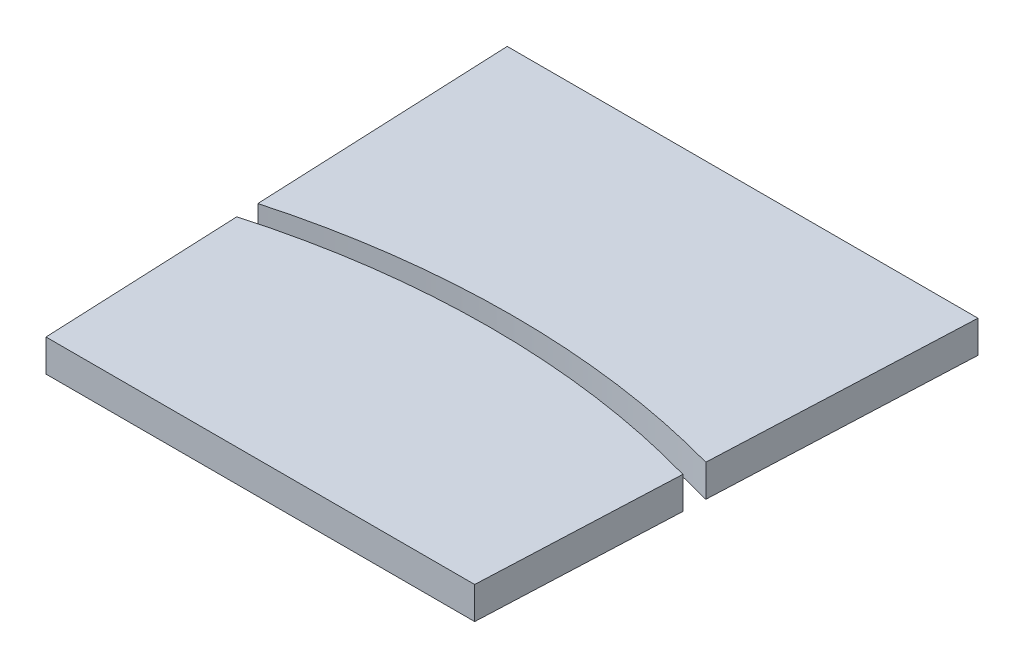
ISO-10303-21;
HEADER;
FILE_DESCRIPTION(('STEP AP214'),'2;1');
FILE_NAME('part.step','',(''),(''),'','','');
FILE_SCHEMA(('AUTOMOTIVE_DESIGN { 1 0 10303 214 1 1 1 1 }'));
ENDSEC;
DATA;
#1=APPLICATION_CONTEXT('core data for automotive mechanical design processes');
#2=APPLICATION_PROTOCOL_DEFINITION('international standard','automotive_design',2000,#1);
#3=PRODUCT_CONTEXT('',#1,'mechanical');
#4=PRODUCT('Part','Part','',(#3));
#5=PRODUCT_RELATED_PRODUCT_CATEGORY('part','',(#4));
#6=PRODUCT_DEFINITION_FORMATION('','',#4);
#7=PRODUCT_DEFINITION_CONTEXT('part definition',#1,'design');
#8=PRODUCT_DEFINITION('design','',#6,#7);
#9=PRODUCT_DEFINITION_SHAPE('','',#8);
#10=(LENGTH_UNIT() NAMED_UNIT(*) SI_UNIT(.MILLI.,.METRE.));
#11=(NAMED_UNIT(*) PLANE_ANGLE_UNIT() SI_UNIT($,.RADIAN.));
#12=(NAMED_UNIT(*) SI_UNIT($,.STERADIAN.) SOLID_ANGLE_UNIT());
#13=UNCERTAINTY_MEASURE_WITH_UNIT(LENGTH_MEASURE(1.E-05),#10,'distance_accuracy_value','');
#14=(GEOMETRIC_REPRESENTATION_CONTEXT(3) GLOBAL_UNCERTAINTY_ASSIGNED_CONTEXT((#13)) GLOBAL_UNIT_ASSIGNED_CONTEXT((#10,
#11,#12)) REPRESENTATION_CONTEXT('',''));
#15=CARTESIAN_POINT('',(0.,0.,0.));
#16=DIRECTION('',(0.,0.,1.));
#17=DIRECTION('',(1.,0.,0.));
#18=AXIS2_PLACEMENT_3D('',#15,#16,#17);
#19=CARTESIAN_POINT('',(-21.964742430883,3.,-100.));
#20=DIRECTION('',(0.999048221581858,0.,-0.0436193873653363));
#21=DIRECTION('',(-0.0436193873653363,0.,-0.999048221581858));
#22=AXIS2_PLACEMENT_3D('',#19,#20,#21);
#23=PLANE('',#22);
#24=DIRECTION('',(0.0436193873653363,0.,0.999048221581858));
#25=VECTOR('',#24,1.);
#26=CARTESIAN_POINT('',(-21.964742430883,3.,-100.));
#27=LINE('',#26,#25);
#28=CARTESIAN_POINT('',(-20.8127224621806,3.,-73.6144047297283));
#29=VERTEX_POINT('',#28);
#30=CARTESIAN_POINT('',(-20.,3.,-55.));
#31=VERTEX_POINT('',#30);
#32=EDGE_CURVE('E86',#29,#31,#27,.T.);
#33=ORIENTED_EDGE('',*,*,#32,.F.);
#34=DIRECTION('',(0.,1.,0.));
#35=VECTOR('',#34,1.);
#36=CARTESIAN_POINT('',(-20.8127224621806,0.,-73.6144047297283));
#37=LINE('',#36,#35);
#38=CARTESIAN_POINT('',(-20.8127224621806,0.,-73.6144047297283));
#39=VERTEX_POINT('',#38);
#40=EDGE_CURVE('E50',#39,#29,#37,.T.);
#41=ORIENTED_EDGE('',*,*,#40,.F.);
#42=DIRECTION('',(0.0436193873653363,0.,0.999048221581858));
#43=VECTOR('',#42,1.);
#44=CARTESIAN_POINT('',(-21.964742430883,0.,-100.));
#45=LINE('',#44,#43);
#46=CARTESIAN_POINT('',(-20.,0.,-55.));
#47=VERTEX_POINT('',#46);
#48=EDGE_CURVE('E78',#39,#47,#45,.T.);
#49=ORIENTED_EDGE('',*,*,#48,.T.);
#50=DIRECTION('',(0.,-1.,0.));
#51=VECTOR('',#50,1.);
#52=CARTESIAN_POINT('',(-20.,3.,-55.));
#53=LINE('',#52,#51);
#54=EDGE_CURVE('E81',#31,#47,#53,.T.);
#55=ORIENTED_EDGE('',*,*,#54,.F.);
#56=EDGE_LOOP('',(#33,#41,#49,#55));
#57=FACE_BOUND('',#56,.T.);
#58=ADVANCED_FACE('F43',(#57),#23,.F.);
#59=CARTESIAN_POINT('',(0.,3.,0.));
#60=DIRECTION('',(0.,-1.,0.));
#61=DIRECTION('',(0.,0.,-1.));
#62=AXIS2_PLACEMENT_3D('',#59,#60,#61);
#63=PLANE('',#62);
#64=DIRECTION('',(-0.0436193873653363,0.,0.999048221581858));
#65=VECTOR('',#64,1.);
#66=CARTESIAN_POINT('',(21.964742430883,3.,-100.));
#67=LINE('',#66,#65);
#68=CARTESIAN_POINT('',(20.8127224621806,3.,-73.6144047297283));
#69=VERTEX_POINT('',#68);
#70=CARTESIAN_POINT('',(20.,3.,-55.));
#71=VERTEX_POINT('',#70);
#72=EDGE_CURVE('E102',#69,#71,#67,.T.);
#73=ORIENTED_EDGE('',*,*,#72,.F.);
#74=CARTESIAN_POINT('',(0.,3.,0.));
#75=DIRECTION('',(0.,1.,0.));
#76=DIRECTION('',(0.,0.,1.));
#77=AXIS2_PLACEMENT_3D('',#74,#75,#76);
#78=CIRCLE('',#77,76.5);
#79=EDGE_CURVE('E12',#29,#69,#78,.F.);
#80=ORIENTED_EDGE('',*,*,#79,.F.);
#81=ORIENTED_EDGE('',*,*,#32,.T.);
#82=DIRECTION('',(1.,0.,0.));
#83=VECTOR('',#82,1.);
#84=CARTESIAN_POINT('',(0.,3.,-55.));
#85=LINE('',#84,#83);
#86=EDGE_CURVE('E95',#31,#71,#85,.T.);
#87=ORIENTED_EDGE('',*,*,#86,.T.);
#88=EDGE_LOOP('',(#73,#80,#81,#87));
#89=FACE_BOUND('',#88,.T.);
#90=ADVANCED_FACE('F116',(#89),#63,.F.);
#91=CARTESIAN_POINT('',(0.,0.,0.));
#92=DIRECTION('',(0.,-1.,0.));
#93=DIRECTION('',(0.,0.,-1.));
#94=AXIS2_PLACEMENT_3D('',#91,#92,#93);
#95=PLANE('',#94);
#96=CARTESIAN_POINT('',(0.,0.,0.));
#97=DIRECTION('',(0.,-1.,0.));
#98=DIRECTION('',(0.,0.,-1.));
#99=AXIS2_PLACEMENT_3D('',#96,#97,#98);
#100=CIRCLE('',#99,76.5);
#101=CARTESIAN_POINT('',(20.8127224621806,0.,-73.6144047297283));
#102=VERTEX_POINT('',#101);
#103=EDGE_CURVE('E105',#39,#102,#100,.T.);
#104=ORIENTED_EDGE('',*,*,#103,.T.);
#105=DIRECTION('',(-0.0436193873653363,0.,0.999048221581858));
#106=VECTOR('',#105,1.);
#107=CARTESIAN_POINT('',(21.964742430883,0.,-100.));
#108=LINE('',#107,#106);
#109=CARTESIAN_POINT('',(20.,0.,-55.));
#110=VERTEX_POINT('',#109);
#111=EDGE_CURVE('E99',#102,#110,#108,.T.);
#112=ORIENTED_EDGE('',*,*,#111,.T.);
#113=DIRECTION('',(1.,0.,0.));
#114=VECTOR('',#113,1.);
#115=CARTESIAN_POINT('',(0.,0.,-55.));
#116=LINE('',#115,#114);
#117=EDGE_CURVE('E92',#47,#110,#116,.T.);
#118=ORIENTED_EDGE('',*,*,#117,.F.);
#119=ORIENTED_EDGE('',*,*,#48,.F.);
#120=EDGE_LOOP('',(#104,#112,#118,#119));
#121=FACE_BOUND('',#120,.T.);
#122=ADVANCED_FACE('F97',(#121),#95,.T.);
#123=CARTESIAN_POINT('',(21.964742430883,3.,-100.));
#124=DIRECTION('',(0.999048221581858,0.,0.0436193873653363));
#125=DIRECTION('',(0.0436193873653363,0.,-0.999048221581858));
#126=AXIS2_PLACEMENT_3D('',#123,#124,#125);
#127=PLANE('',#126);
#128=DIRECTION('',(0.,1.,0.));
#129=VECTOR('',#128,1.);
#130=CARTESIAN_POINT('',(20.8127224621806,0.,-73.6144047297283));
#131=LINE('',#130,#129);
#132=EDGE_CURVE('E107',#102,#69,#131,.T.);
#133=ORIENTED_EDGE('',*,*,#132,.T.);
#134=ORIENTED_EDGE('',*,*,#72,.T.);
#135=DIRECTION('',(0.,-1.,0.));
#136=VECTOR('',#135,1.);
#137=CARTESIAN_POINT('',(20.,3.,-55.));
#138=LINE('',#137,#136);
#139=EDGE_CURVE('E100',#71,#110,#138,.T.);
#140=ORIENTED_EDGE('',*,*,#139,.T.);
#141=ORIENTED_EDGE('',*,*,#111,.F.);
#142=EDGE_LOOP('',(#133,#134,#140,#141));
#143=FACE_BOUND('',#142,.T.);
#144=ADVANCED_FACE('F114',(#143),#127,.T.);
#145=CARTESIAN_POINT('',(0.,3.,-55.));
#146=DIRECTION('',(0.,0.,-1.));
#147=DIRECTION('',(-1.,0.,0.));
#148=AXIS2_PLACEMENT_3D('',#145,#146,#147);
#149=PLANE('',#148);
#150=ORIENTED_EDGE('',*,*,#117,.T.);
#151=ORIENTED_EDGE('',*,*,#139,.F.);
#152=ORIENTED_EDGE('',*,*,#86,.F.);
#153=ORIENTED_EDGE('',*,*,#54,.T.);
#154=EDGE_LOOP('',(#150,#151,#152,#153));
#155=FACE_BOUND('',#154,.T.);
#156=ADVANCED_FACE('F90',(#155),#149,.F.);
#157=CARTESIAN_POINT('',(0.,0.,0.));
#158=DIRECTION('',(0.,1.,0.));
#159=DIRECTION('',(0.,0.,1.));
#160=AXIS2_PLACEMENT_3D('',#157,#158,#159);
#161=CYLINDRICAL_SURFACE('',#160,76.5);
#162=ORIENTED_EDGE('',*,*,#132,.F.);
#163=ORIENTED_EDGE('',*,*,#103,.F.);
#164=ORIENTED_EDGE('',*,*,#40,.T.);
#165=ORIENTED_EDGE('',*,*,#79,.T.);
#166=EDGE_LOOP('',(#162,#163,#164,#165));
#167=FACE_BOUND('',#166,.T.);
#168=ADVANCED_FACE('F126',(#167),#161,.T.);
#169=CLOSED_SHELL('',(#58,#90,#122,#144,#156,#168));
#170=MANIFOLD_SOLID_BREP('B2',#169);
#171=CARTESIAN_POINT('',(-21.964742430883,3.,-100.));
#172=DIRECTION('',(0.,0.,1.));
#173=DIRECTION('',(1.,0.,0.));
#174=AXIS2_PLACEMENT_3D('',#171,#172,#173);
#175=PLANE('',#174);
#176=DIRECTION('',(-1.,0.,0.));
#177=VECTOR('',#176,1.);
#178=CARTESIAN_POINT('',(-21.964742430883,0.,-100.));
#179=LINE('',#178,#177);
#180=CARTESIAN_POINT('',(21.964742430883,0.,-100.));
#181=VERTEX_POINT('',#180);
#182=CARTESIAN_POINT('',(-21.964742430883,0.,-100.));
#183=VERTEX_POINT('',#182);
#184=EDGE_CURVE('E217',#181,#183,#179,.T.);
#185=ORIENTED_EDGE('',*,*,#184,.T.);
#186=DIRECTION('',(0.,-1.,0.));
#187=VECTOR('',#186,1.);
#188=CARTESIAN_POINT('',(-21.964742430883,3.,-100.));
#189=LINE('',#188,#187);
#190=CARTESIAN_POINT('',(-21.964742430883,3.,-100.));
#191=VERTEX_POINT('',#190);
#192=EDGE_CURVE('E41',#191,#183,#189,.T.);
#193=ORIENTED_EDGE('',*,*,#192,.F.);
#194=DIRECTION('',(-1.,0.,0.));
#195=VECTOR('',#194,1.);
#196=CARTESIAN_POINT('',(-21.964742430883,3.,-100.));
#197=LINE('',#196,#195);
#198=CARTESIAN_POINT('',(21.964742430883,3.,-100.));
#199=VERTEX_POINT('',#198);
#200=EDGE_CURVE('E230',#199,#191,#197,.T.);
#201=ORIENTED_EDGE('',*,*,#200,.F.);
#202=DIRECTION('',(0.,-1.,0.));
#203=VECTOR('',#202,1.);
#204=CARTESIAN_POINT('',(21.964742430883,3.,-100.));
#205=LINE('',#204,#203);
#206=EDGE_CURVE('E226',#199,#181,#205,.T.);
#207=ORIENTED_EDGE('',*,*,#206,.T.);
#208=EDGE_LOOP('',(#185,#193,#201,#207));
#209=FACE_BOUND('',#208,.T.);
#210=ADVANCED_FACE('F176',(#209),#175,.F.);
#211=CARTESIAN_POINT('',(21.964742430883,3.,-100.));
#212=DIRECTION('',(0.999048221581858,0.,0.0436193873653363));
#213=DIRECTION('',(0.0436193873653363,0.,-0.999048221581858));
#214=AXIS2_PLACEMENT_3D('',#211,#212,#213);
#215=PLANE('',#214);
#216=DIRECTION('',(0.,1.,0.));
#217=VECTOR('',#216,1.);
#218=CARTESIAN_POINT('',(20.9022971665035,0.,-75.6660027566091));
#219=LINE('',#218,#217);
#220=CARTESIAN_POINT('',(20.9022971665035,0.,-75.6660027566093));
#221=VERTEX_POINT('',#220);
#222=CARTESIAN_POINT('',(20.9022971665035,3.,-75.6660027566091));
#223=VERTEX_POINT('',#222);
#224=EDGE_CURVE('E202',#221,#223,#219,.T.);
#225=ORIENTED_EDGE('',*,*,#224,.F.);
#226=DIRECTION('',(-0.0436193873653363,0.,0.999048221581858));
#227=VECTOR('',#226,1.);
#228=CARTESIAN_POINT('',(21.964742430883,0.,-100.));
#229=LINE('',#228,#227);
#230=EDGE_CURVE('E221',#181,#221,#229,.T.);
#231=ORIENTED_EDGE('',*,*,#230,.F.);
#232=ORIENTED_EDGE('',*,*,#206,.F.);
#233=DIRECTION('',(-0.0436193873653363,0.,0.999048221581858));
#234=VECTOR('',#233,1.);
#235=CARTESIAN_POINT('',(21.964742430883,3.,-100.));
#236=LINE('',#235,#234);
#237=EDGE_CURVE('E234',#199,#223,#236,.T.);
#238=ORIENTED_EDGE('',*,*,#237,.T.);
#239=EDGE_LOOP('',(#225,#231,#232,#238));
#240=FACE_BOUND('',#239,.T.);
#241=ADVANCED_FACE('F236',(#240),#215,.T.);
#242=CARTESIAN_POINT('',(0.,0.,0.));
#243=DIRECTION('',(0.,-1.,0.));
#244=DIRECTION('',(0.,0.,-1.));
#245=AXIS2_PLACEMENT_3D('',#242,#243,#244);
#246=PLANE('',#245);
#247=CARTESIAN_POINT('',(0.,0.,0.));
#248=DIRECTION('',(0.,1.,0.));
#249=DIRECTION('',(0.,0.,-1.));
#250=AXIS2_PLACEMENT_3D('',#247,#248,#249);
#251=CIRCLE('',#250,78.5);
#252=CARTESIAN_POINT('',(-20.9022971665035,0.,-75.6660027566091));
#253=VERTEX_POINT('',#252);
#254=EDGE_CURVE('E193',#221,#253,#251,.T.);
#255=ORIENTED_EDGE('',*,*,#254,.T.);
#256=DIRECTION('',(0.0436193873653363,0.,0.999048221581858));
#257=VECTOR('',#256,1.);
#258=CARTESIAN_POINT('',(-21.964742430883,0.,-100.));
#259=LINE('',#258,#257);
#260=EDGE_CURVE('E223',#183,#253,#259,.T.);
#261=ORIENTED_EDGE('',*,*,#260,.F.);
#262=ORIENTED_EDGE('',*,*,#184,.F.);
#263=ORIENTED_EDGE('',*,*,#230,.T.);
#264=EDGE_LOOP('',(#255,#261,#262,#263));
#265=FACE_BOUND('',#264,.T.);
#266=ADVANCED_FACE('F219',(#265),#246,.T.);
#267=CARTESIAN_POINT('',(0.,3.,0.));
#268=DIRECTION('',(0.,-1.,0.));
#269=DIRECTION('',(0.,0.,-1.));
#270=AXIS2_PLACEMENT_3D('',#267,#268,#269);
#271=PLANE('',#270);
#272=DIRECTION('',(0.0436193873653363,0.,0.999048221581858));
#273=VECTOR('',#272,1.);
#274=CARTESIAN_POINT('',(-21.964742430883,3.,-100.));
#275=LINE('',#274,#273);
#276=CARTESIAN_POINT('',(-20.9022971665035,3.,-75.6660027566091));
#277=VERTEX_POINT('',#276);
#278=EDGE_CURVE('E185',#191,#277,#275,.T.);
#279=ORIENTED_EDGE('',*,*,#278,.T.);
#280=CARTESIAN_POINT('',(0.,3.,0.));
#281=DIRECTION('',(0.,1.,0.));
#282=DIRECTION('',(0.,0.,1.));
#283=AXIS2_PLACEMENT_3D('',#280,#281,#282);
#284=CIRCLE('',#283,78.5);
#285=EDGE_CURVE('E179',#223,#277,#284,.T.);
#286=ORIENTED_EDGE('',*,*,#285,.F.);
#287=ORIENTED_EDGE('',*,*,#237,.F.);
#288=ORIENTED_EDGE('',*,*,#200,.T.);
#289=EDGE_LOOP('',(#279,#286,#287,#288));
#290=FACE_BOUND('',#289,.T.);
#291=ADVANCED_FACE('F247',(#290),#271,.F.);
#292=CARTESIAN_POINT('',(-21.964742430883,3.,-100.));
#293=DIRECTION('',(0.999048221581858,0.,-0.0436193873653363));
#294=DIRECTION('',(-0.0436193873653363,0.,-0.999048221581858));
#295=AXIS2_PLACEMENT_3D('',#292,#293,#294);
#296=PLANE('',#295);
#297=ORIENTED_EDGE('',*,*,#260,.T.);
#298=DIRECTION('',(0.,1.,0.));
#299=VECTOR('',#298,1.);
#300=CARTESIAN_POINT('',(-20.9022971665035,0.,-75.6660027566091));
#301=LINE('',#300,#299);
#302=EDGE_CURVE('E207',#253,#277,#301,.T.);
#303=ORIENTED_EDGE('',*,*,#302,.T.);
#304=ORIENTED_EDGE('',*,*,#278,.F.);
#305=ORIENTED_EDGE('',*,*,#192,.T.);
#306=EDGE_LOOP('',(#297,#303,#304,#305));
#307=FACE_BOUND('',#306,.T.);
#308=ADVANCED_FACE('F245',(#307),#296,.F.);
#309=CARTESIAN_POINT('',(0.,0.,0.));
#310=DIRECTION('',(0.,1.,0.));
#311=DIRECTION('',(0.,0.,1.));
#312=AXIS2_PLACEMENT_3D('',#309,#310,#311);
#313=CYLINDRICAL_SURFACE('',#312,78.5);
#314=ORIENTED_EDGE('',*,*,#302,.F.);
#315=ORIENTED_EDGE('',*,*,#254,.F.);
#316=ORIENTED_EDGE('',*,*,#224,.T.);
#317=ORIENTED_EDGE('',*,*,#285,.T.);
#318=EDGE_LOOP('',(#314,#315,#316,#317));
#319=FACE_BOUND('',#318,.T.);
#320=ADVANCED_FACE('F248',(#319),#313,.F.);
#321=CLOSED_SHELL('',(#210,#241,#266,#291,#308,#320));
#322=MANIFOLD_SOLID_BREP('B6',#321);
#323=ADVANCED_BREP_SHAPE_REPRESENTATION('',(#18,#170,#322),#14);
#324=SHAPE_DEFINITION_REPRESENTATION(#9,#323);
ENDSEC;
END-ISO-10303-21;
